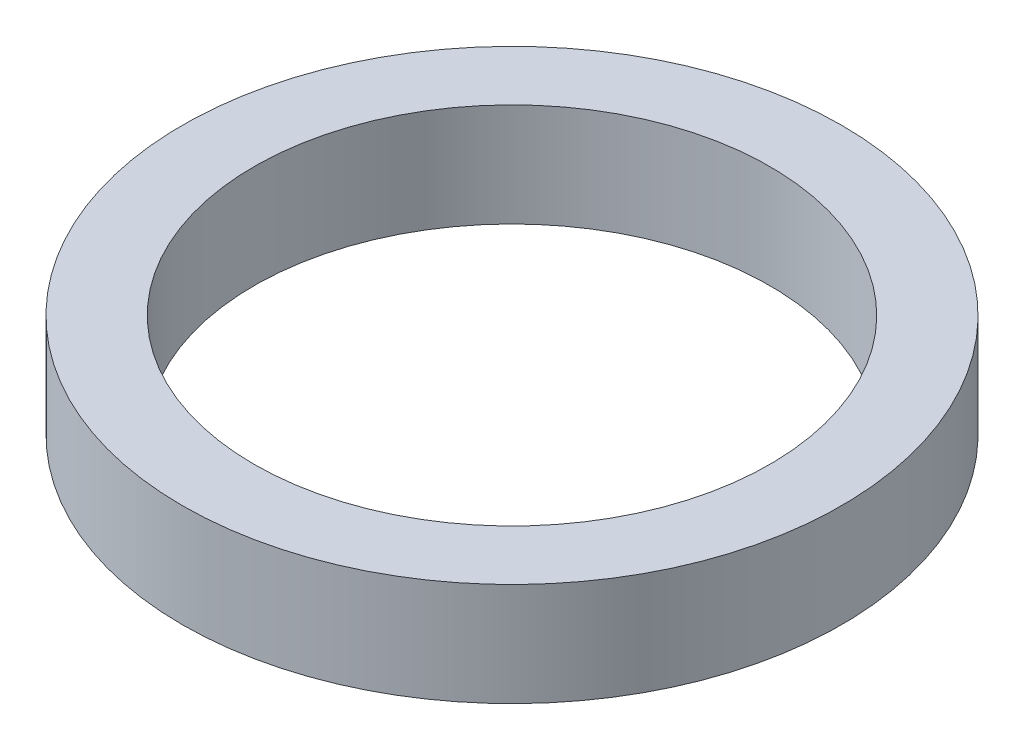
ISO-10303-21;
HEADER;
FILE_DESCRIPTION(('STEP AP214'),'2;1');
FILE_NAME('part.step','',(''),(''),'','','');
FILE_SCHEMA(('AUTOMOTIVE_DESIGN { 1 0 10303 214 1 1 1 1 }'));
ENDSEC;
DATA;
#1=APPLICATION_CONTEXT('core data for automotive mechanical design processes');
#2=APPLICATION_PROTOCOL_DEFINITION('international standard','automotive_design',2000,#1);
#3=PRODUCT_CONTEXT('',#1,'mechanical');
#4=PRODUCT('Part','Part','',(#3));
#5=PRODUCT_RELATED_PRODUCT_CATEGORY('part','',(#4));
#6=PRODUCT_DEFINITION_FORMATION('','',#4);
#7=PRODUCT_DEFINITION_CONTEXT('part definition',#1,'design');
#8=PRODUCT_DEFINITION('design','',#6,#7);
#9=PRODUCT_DEFINITION_SHAPE('','',#8);
#10=(LENGTH_UNIT() NAMED_UNIT(*) SI_UNIT(.MILLI.,.METRE.));
#11=(NAMED_UNIT(*) PLANE_ANGLE_UNIT() SI_UNIT($,.RADIAN.));
#12=(NAMED_UNIT(*) SI_UNIT($,.STERADIAN.) SOLID_ANGLE_UNIT());
#13=UNCERTAINTY_MEASURE_WITH_UNIT(LENGTH_MEASURE(1.E-05),#10,'distance_accuracy_value','');
#14=(GEOMETRIC_REPRESENTATION_CONTEXT(3) GLOBAL_UNCERTAINTY_ASSIGNED_CONTEXT((#13)) GLOBAL_UNIT_ASSIGNED_CONTEXT((#10,
#11,#12)) REPRESENTATION_CONTEXT('',''));
#15=CARTESIAN_POINT('',(0.,0.,0.));
#16=DIRECTION('',(0.,0.,1.));
#17=DIRECTION('',(1.,0.,0.));
#18=AXIS2_PLACEMENT_3D('',#15,#16,#17);
#19=CARTESIAN_POINT('',(0.,18.,0.));
#20=DIRECTION('',(0.,-1.,0.));
#21=DIRECTION('',(0.,0.,-1.));
#22=AXIS2_PLACEMENT_3D('',#19,#20,#21);
#23=CYLINDRICAL_SURFACE('',#22,57.5);
#24=CARTESIAN_POINT('',(0.,18.,0.));
#25=DIRECTION('',(0.,1.,0.));
#26=DIRECTION('',(0.,0.,1.));
#27=AXIS2_PLACEMENT_3D('',#24,#25,#26);
#28=CIRCLE('',#27,57.5);
#29=CARTESIAN_POINT('',(0.,18.,57.5));
#30=VERTEX_POINT('',#29);
#31=EDGE_CURVE('E10',#30,#30,#28,.T.);
#32=ORIENTED_EDGE('',*,*,#31,.F.);
#33=EDGE_LOOP('',(#32));
#34=FACE_BOUND('',#33,.T.);
#35=CARTESIAN_POINT('',(0.,0.,0.));
#36=DIRECTION('',(0.,1.,0.));
#37=DIRECTION('',(0.,0.,1.));
#38=AXIS2_PLACEMENT_3D('',#35,#36,#37);
#39=CIRCLE('',#38,57.5);
#40=CARTESIAN_POINT('',(0.,0.,57.5));
#41=VERTEX_POINT('',#40);
#42=EDGE_CURVE('E37',#41,#41,#39,.T.);
#43=ORIENTED_EDGE('',*,*,#42,.T.);
#44=EDGE_LOOP('',(#43));
#45=FACE_BOUND('',#44,.T.);
#46=ADVANCED_FACE('F40',(#34,#45),#23,.T.);
#47=CARTESIAN_POINT('',(0.,18.,0.));
#48=DIRECTION('',(0.,1.,0.));
#49=DIRECTION('',(0.,0.,1.));
#50=AXIS2_PLACEMENT_3D('',#47,#48,#49);
#51=PLANE('',#50);
#52=CARTESIAN_POINT('',(0.,18.,0.));
#53=DIRECTION('',(0.,1.,0.));
#54=DIRECTION('',(0.,0.,1.));
#55=AXIS2_PLACEMENT_3D('',#52,#53,#54);
#56=CIRCLE('',#55,45.);
#57=CARTESIAN_POINT('',(0.,18.,45.));
#58=VERTEX_POINT('',#57);
#59=EDGE_CURVE('E50',#58,#58,#56,.T.);
#60=ORIENTED_EDGE('',*,*,#59,.F.);
#61=EDGE_LOOP('',(#60));
#62=FACE_BOUND('',#61,.T.);
#63=ORIENTED_EDGE('',*,*,#31,.T.);
#64=EDGE_LOOP('',(#63));
#65=FACE_BOUND('',#64,.T.);
#66=ADVANCED_FACE('F59',(#62,#65),#51,.T.);
#67=CARTESIAN_POINT('',(0.,0.,0.));
#68=DIRECTION('',(0.,1.,0.));
#69=DIRECTION('',(0.,0.,1.));
#70=AXIS2_PLACEMENT_3D('',#67,#68,#69);
#71=PLANE('',#70);
#72=CARTESIAN_POINT('',(0.,0.,0.));
#73=DIRECTION('',(0.,1.,0.));
#74=DIRECTION('',(0.,0.,1.));
#75=AXIS2_PLACEMENT_3D('',#72,#73,#74);
#76=CIRCLE('',#75,45.);
#77=CARTESIAN_POINT('',(0.,0.,45.));
#78=VERTEX_POINT('',#77);
#79=EDGE_CURVE('E47',#78,#78,#76,.T.);
#80=ORIENTED_EDGE('',*,*,#79,.T.);
#81=EDGE_LOOP('',(#80));
#82=FACE_BOUND('',#81,.T.);
#83=ORIENTED_EDGE('',*,*,#42,.F.);
#84=EDGE_LOOP('',(#83));
#85=FACE_BOUND('',#84,.T.);
#86=ADVANCED_FACE('F58',(#82,#85),#71,.F.);
#87=CARTESIAN_POINT('',(0.,18.,0.));
#88=DIRECTION('',(0.,-1.,0.));
#89=DIRECTION('',(0.,0.,-1.));
#90=AXIS2_PLACEMENT_3D('',#87,#88,#89);
#91=CYLINDRICAL_SURFACE('',#90,45.);
#92=ORIENTED_EDGE('',*,*,#59,.T.);
#93=EDGE_LOOP('',(#92));
#94=FACE_BOUND('',#93,.T.);
#95=ORIENTED_EDGE('',*,*,#79,.F.);
#96=EDGE_LOOP('',(#95));
#97=FACE_BOUND('',#96,.T.);
#98=ADVANCED_FACE('F54',(#94,#97),#91,.F.);
#99=CLOSED_SHELL('',(#46,#66,#86,#98));
#100=MANIFOLD_SOLID_BREP('B2',#99);
#101=ADVANCED_BREP_SHAPE_REPRESENTATION('',(#18,#100),#14);
#102=SHAPE_DEFINITION_REPRESENTATION(#9,#101);
ENDSEC;
END-ISO-10303-21;
